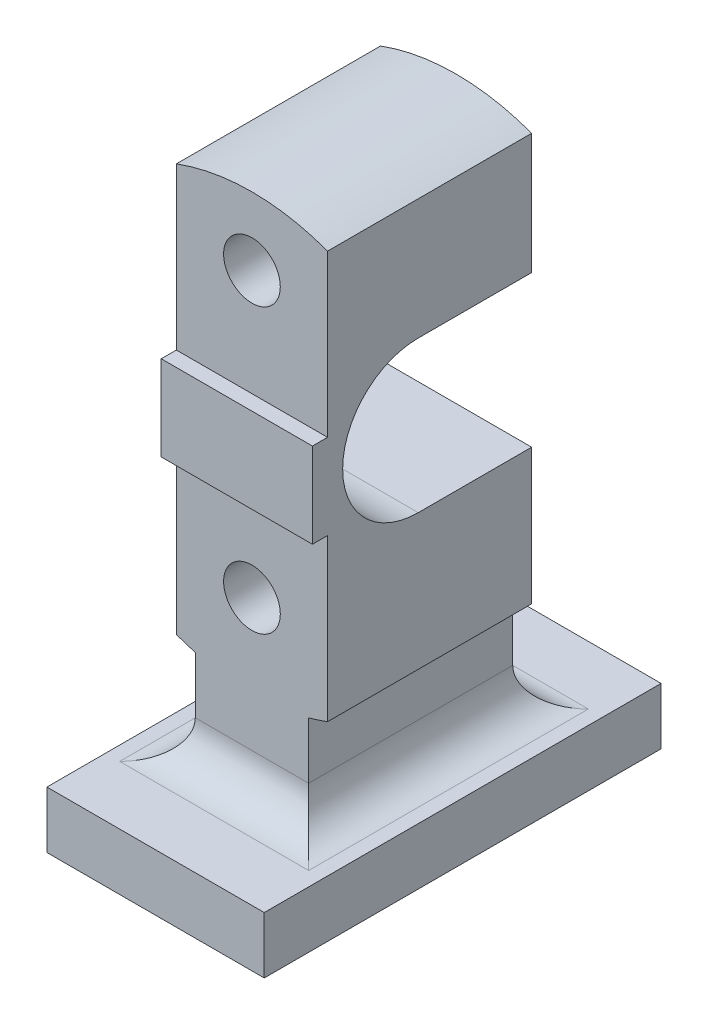
ISO-10303-21;
HEADER;
FILE_DESCRIPTION(('STEP AP214'),'2;1');
FILE_NAME('part.step','',(''),(''),'','','');
FILE_SCHEMA(('AUTOMOTIVE_DESIGN { 1 0 10303 214 1 1 1 1 }'));
ENDSEC;
DATA;
#1=APPLICATION_CONTEXT('core data for automotive mechanical design processes');
#2=APPLICATION_PROTOCOL_DEFINITION('international standard','automotive_design',2000,#1);
#3=PRODUCT_CONTEXT('',#1,'mechanical');
#4=PRODUCT('Part','Part','',(#3));
#5=PRODUCT_RELATED_PRODUCT_CATEGORY('part','',(#4));
#6=PRODUCT_DEFINITION_FORMATION('','',#4);
#7=PRODUCT_DEFINITION_CONTEXT('part definition',#1,'design');
#8=PRODUCT_DEFINITION('design','',#6,#7);
#9=PRODUCT_DEFINITION_SHAPE('','',#8);
#10=(LENGTH_UNIT() NAMED_UNIT(*) SI_UNIT(.MILLI.,.METRE.));
#11=(NAMED_UNIT(*) PLANE_ANGLE_UNIT() SI_UNIT($,.RADIAN.));
#12=(NAMED_UNIT(*) SI_UNIT($,.STERADIAN.) SOLID_ANGLE_UNIT());
#13=UNCERTAINTY_MEASURE_WITH_UNIT(LENGTH_MEASURE(1.E-05),#10,'distance_accuracy_value','');
#14=(GEOMETRIC_REPRESENTATION_CONTEXT(3) GLOBAL_UNCERTAINTY_ASSIGNED_CONTEXT((#13)) GLOBAL_UNIT_ASSIGNED_CONTEXT((#10,
#11,#12)) REPRESENTATION_CONTEXT('',''));
#15=CARTESIAN_POINT('',(0.,0.,0.));
#16=DIRECTION('',(0.,0.,1.));
#17=DIRECTION('',(1.,0.,0.));
#18=AXIS2_PLACEMENT_3D('',#15,#16,#17);
#19=CARTESIAN_POINT('',(40.,0.,54.));
#20=DIRECTION('',(1.,0.,0.));
#21=DIRECTION('',(0.,1.,0.));
#22=AXIS2_PLACEMENT_3D('',#19,#20,#21);
#23=PLANE('',#22);
#24=CARTESIAN_POINT('',(40.,3.98198344412737,5.99999999999998));
#25=DIRECTION('',(1.,0.,0.));
#26=DIRECTION('',(0.,1.,0.));
#27=AXIS2_PLACEMENT_3D('',#24,#25,#26);
#28=CIRCLE('',#27,40.);
#29=CARTESIAN_POINT('',(40.,-36.0180165558726,5.99999999999998));
#30=VERTEX_POINT('',#29);
#31=CARTESIAN_POINT('',(40.,43.9819834441274,5.99999999999998));
#32=VERTEX_POINT('',#31);
#33=EDGE_CURVE('E292',#30,#32,#28,.F.);
#34=ORIENTED_EDGE('',*,*,#33,.T.);
#35=DIRECTION('',(0.,0.,-1.));
#36=VECTOR('',#35,1.);
#37=CARTESIAN_POINT('',(40.,43.9819834441274,54.));
#38=LINE('',#37,#36);
#39=CARTESIAN_POINT('',(40.,43.9819834441274,-54.));
#40=VERTEX_POINT('',#39);
#41=EDGE_CURVE('E289',#32,#40,#38,.T.);
#42=ORIENTED_EDGE('',*,*,#41,.T.);
#43=DIRECTION('',(0.,-1.,0.));
#44=VECTOR('',#43,1.);
#45=CARTESIAN_POINT('',(40.,0.,-54.));
#46=LINE('',#45,#44);
#47=CARTESIAN_POINT('',(40.,107.819293264239,-54.));
#48=VERTEX_POINT('',#47);
#49=EDGE_CURVE('E358',#48,#40,#46,.T.);
#50=ORIENTED_EDGE('',*,*,#49,.F.);
#51=DIRECTION('',(0.,0.,-1.));
#52=VECTOR('',#51,1.);
#53=CARTESIAN_POINT('',(40.,107.819293264239,54.));
#54=LINE('',#53,#52);
#55=CARTESIAN_POINT('',(40.,107.819293264239,54.));
#56=VERTEX_POINT('',#55);
#57=EDGE_CURVE('E386',#56,#48,#54,.T.);
#58=ORIENTED_EDGE('',*,*,#57,.F.);
#59=DIRECTION('',(0.,-1.,0.));
#60=VECTOR('',#59,1.);
#61=CARTESIAN_POINT('',(40.,0.,54.));
#62=LINE('',#61,#60);
#63=CARTESIAN_POINT('',(40.,22.5,54.));
#64=VERTEX_POINT('',#63);
#65=EDGE_CURVE('E332',#56,#64,#62,.T.);
#66=ORIENTED_EDGE('',*,*,#65,.T.);
#67=DIRECTION('',(0.,0.,-1.));
#68=VECTOR('',#67,1.);
#69=CARTESIAN_POINT('',(40.,22.5,62.));
#70=LINE('',#69,#68);
#71=CARTESIAN_POINT('',(40.,22.5,62.));
#72=VERTEX_POINT('',#71);
#73=EDGE_CURVE('E317',#72,#64,#70,.T.);
#74=ORIENTED_EDGE('',*,*,#73,.F.);
#75=DIRECTION('',(0.,-1.,0.));
#76=VECTOR('',#75,1.);
#77=CARTESIAN_POINT('',(40.,0.,62.));
#78=LINE('',#77,#76);
#79=CARTESIAN_POINT('',(40.,-22.5,62.));
#80=VERTEX_POINT('',#79);
#81=EDGE_CURVE('E298',#72,#80,#78,.T.);
#82=ORIENTED_EDGE('',*,*,#81,.T.);
#83=DIRECTION('',(0.,0.,-1.));
#84=VECTOR('',#83,1.);
#85=CARTESIAN_POINT('',(40.,-22.5,62.));
#86=LINE('',#85,#84);
#87=CARTESIAN_POINT('',(40.,-22.5,54.));
#88=VERTEX_POINT('',#87);
#89=EDGE_CURVE('E321',#80,#88,#86,.T.);
#90=ORIENTED_EDGE('',*,*,#89,.T.);
#91=CARTESIAN_POINT('',(40.,-107.819293264239,54.));
#92=VERTEX_POINT('',#91);
#93=EDGE_CURVE('E330',#88,#92,#62,.T.);
#94=ORIENTED_EDGE('',*,*,#93,.T.);
#95=DIRECTION('',(0.,0.,-1.));
#96=VECTOR('',#95,1.);
#97=CARTESIAN_POINT('',(40.,-107.819293264239,54.));
#98=LINE('',#97,#96);
#99=CARTESIAN_POINT('',(40.,-107.819293264239,-54.));
#100=VERTEX_POINT('',#99);
#101=EDGE_CURVE('E389',#92,#100,#98,.T.);
#102=ORIENTED_EDGE('',*,*,#101,.T.);
#103=CARTESIAN_POINT('',(40.,-36.0180165558726,-54.));
#104=VERTEX_POINT('',#103);
#105=EDGE_CURVE('E357',#104,#100,#46,.T.);
#106=ORIENTED_EDGE('',*,*,#105,.F.);
#107=DIRECTION('',(0.,0.,1.));
#108=VECTOR('',#107,1.);
#109=CARTESIAN_POINT('',(40.,-36.0180165558726,54.));
#110=LINE('',#109,#108);
#111=EDGE_CURVE('E213',#104,#30,#110,.T.);
#112=ORIENTED_EDGE('',*,*,#111,.T.);
#113=EDGE_LOOP('',(#34,#42,#50,#58,#66,#74,#82,#90,#94,#102,#106,#112));
#114=FACE_BOUND('',#113,.T.);
#115=ADVANCED_FACE('F39',(#114),#23,.T.);
#116=CARTESIAN_POINT('',(-40.,0.,54.));
#117=DIRECTION('',(1.,0.,0.));
#118=DIRECTION('',(0.,0.,-1.));
#119=AXIS2_PLACEMENT_3D('',#116,#117,#118);
#120=PLANE('',#119);
#121=DIRECTION('',(0.,0.,-1.));
#122=VECTOR('',#121,1.);
#123=CARTESIAN_POINT('',(-40.,43.9819834441274,54.));
#124=LINE('',#123,#122);
#125=CARTESIAN_POINT('',(-40.,43.9819834441274,5.99999999999998));
#126=VERTEX_POINT('',#125);
#127=CARTESIAN_POINT('',(-40.,43.9819834441274,-54.));
#128=VERTEX_POINT('',#127);
#129=EDGE_CURVE('E285',#126,#128,#124,.T.);
#130=ORIENTED_EDGE('',*,*,#129,.F.);
#131=CARTESIAN_POINT('',(-40.,3.98198344412736,5.99999999999998));
#132=DIRECTION('',(1.,0.,0.));
#133=DIRECTION('',(0.,0.,-1.));
#134=AXIS2_PLACEMENT_3D('',#131,#132,#133);
#135=CIRCLE('',#134,40.);
#136=CARTESIAN_POINT('',(-40.,-36.0180165558726,5.99999999999998));
#137=VERTEX_POINT('',#136);
#138=EDGE_CURVE('E208',#137,#126,#135,.F.);
#139=ORIENTED_EDGE('',*,*,#138,.F.);
#140=DIRECTION('',(0.,0.,1.));
#141=VECTOR('',#140,1.);
#142=CARTESIAN_POINT('',(-40.,-36.0180165558726,54.));
#143=LINE('',#142,#141);
#144=CARTESIAN_POINT('',(-40.,-36.0180165558726,-54.));
#145=VERTEX_POINT('',#144);
#146=EDGE_CURVE('E205',#145,#137,#143,.T.);
#147=ORIENTED_EDGE('',*,*,#146,.F.);
#148=DIRECTION('',(0.,-1.,0.));
#149=VECTOR('',#148,1.);
#150=CARTESIAN_POINT('',(-40.,0.,-54.));
#151=LINE('',#150,#149);
#152=CARTESIAN_POINT('',(-40.,-107.819293264239,-54.));
#153=VERTEX_POINT('',#152);
#154=EDGE_CURVE('E190',#145,#153,#151,.T.);
#155=ORIENTED_EDGE('',*,*,#154,.T.);
#156=DIRECTION('',(0.,0.,-1.));
#157=VECTOR('',#156,1.);
#158=CARTESIAN_POINT('',(-40.,-107.819293264239,54.));
#159=LINE('',#158,#157);
#160=CARTESIAN_POINT('',(-40.,-107.819293264239,54.));
#161=VERTEX_POINT('',#160);
#162=EDGE_CURVE('E379',#161,#153,#159,.T.);
#163=ORIENTED_EDGE('',*,*,#162,.F.);
#164=DIRECTION('',(0.,-1.,0.));
#165=VECTOR('',#164,1.);
#166=CARTESIAN_POINT('',(-40.,0.,54.));
#167=LINE('',#166,#165);
#168=CARTESIAN_POINT('',(-40.,-22.5,54.));
#169=VERTEX_POINT('',#168);
#170=EDGE_CURVE('E339',#169,#161,#167,.T.);
#171=ORIENTED_EDGE('',*,*,#170,.F.);
#172=DIRECTION('',(0.,0.,-1.));
#173=VECTOR('',#172,1.);
#174=CARTESIAN_POINT('',(-40.,-22.5,62.));
#175=LINE('',#174,#173);
#176=CARTESIAN_POINT('',(-40.,-22.5,62.));
#177=VERTEX_POINT('',#176);
#178=EDGE_CURVE('E309',#177,#169,#175,.T.);
#179=ORIENTED_EDGE('',*,*,#178,.F.);
#180=DIRECTION('',(0.,-1.,0.));
#181=VECTOR('',#180,1.);
#182=CARTESIAN_POINT('',(-40.,0.,62.));
#183=LINE('',#182,#181);
#184=CARTESIAN_POINT('',(-40.,22.5,62.));
#185=VERTEX_POINT('',#184);
#186=EDGE_CURVE('E306',#185,#177,#183,.T.);
#187=ORIENTED_EDGE('',*,*,#186,.F.);
#188=DIRECTION('',(0.,0.,-1.));
#189=VECTOR('',#188,1.);
#190=CARTESIAN_POINT('',(-40.,22.5,62.));
#191=LINE('',#190,#189);
#192=CARTESIAN_POINT('',(-40.,22.5,54.));
#193=VERTEX_POINT('',#192);
#194=EDGE_CURVE('E313',#185,#193,#191,.T.);
#195=ORIENTED_EDGE('',*,*,#194,.T.);
#196=CARTESIAN_POINT('',(-40.,107.819293264239,54.));
#197=VERTEX_POINT('',#196);
#198=EDGE_CURVE('E340',#197,#193,#167,.T.);
#199=ORIENTED_EDGE('',*,*,#198,.F.);
#200=DIRECTION('',(0.,0.,-1.));
#201=VECTOR('',#200,1.);
#202=CARTESIAN_POINT('',(-40.,107.819293264239,54.));
#203=LINE('',#202,#201);
#204=CARTESIAN_POINT('',(-40.,107.819293264239,-54.));
#205=VERTEX_POINT('',#204);
#206=EDGE_CURVE('E382',#197,#205,#203,.T.);
#207=ORIENTED_EDGE('',*,*,#206,.T.);
#208=EDGE_CURVE('E201',#205,#128,#151,.T.);
#209=ORIENTED_EDGE('',*,*,#208,.T.);
#210=EDGE_LOOP('',(#130,#139,#147,#155,#163,#171,#179,#187,#195,#199,#207,#209));
#211=FACE_BOUND('',#210,.T.);
#212=ADVANCED_FACE('F206',(#211),#120,.F.);
#213=CARTESIAN_POINT('',(0.,0.,-54.));
#214=DIRECTION('',(0.,0.,1.));
#215=DIRECTION('',(1.,0.,0.));
#216=AXIS2_PLACEMENT_3D('',#213,#214,#215);
#217=PLANE('',#216);
#218=CARTESIAN_POINT('',(0.,78.9819834441274,-54.));
#219=DIRECTION('',(0.,0.,1.));
#220=DIRECTION('',(1.,0.,0.));
#221=AXIS2_PLACEMENT_3D('',#218,#219,#220);
#222=CIRCLE('',#221,15.);
#223=CARTESIAN_POINT('',(15.,78.9819834441274,-54.));
#224=VERTEX_POINT('',#223);
#225=EDGE_CURVE('E815',#224,#224,#222,.T.);
#226=ORIENTED_EDGE('',*,*,#225,.T.);
#227=EDGE_LOOP('',(#226));
#228=FACE_BOUND('',#227,.T.);
#229=DIRECTION('',(1.,0.,0.));
#230=VECTOR('',#229,1.);
#231=CARTESIAN_POINT('',(0.,43.9819834441274,-54.));
#232=LINE('',#231,#230);
#233=EDGE_CURVE('E219',#128,#40,#232,.T.);
#234=ORIENTED_EDGE('',*,*,#233,.F.);
#235=ORIENTED_EDGE('',*,*,#208,.F.);
#236=CARTESIAN_POINT('',(0.,0.,-54.));
#237=DIRECTION('',(0.,0.,1.));
#238=DIRECTION('',(1.,0.,0.));
#239=AXIS2_PLACEMENT_3D('',#236,#237,#238);
#240=CIRCLE('',#239,115.);
#241=EDGE_CURVE('E202',#48,#205,#240,.T.);
#242=ORIENTED_EDGE('',*,*,#241,.F.);
#243=ORIENTED_EDGE('',*,*,#49,.T.);
#244=EDGE_LOOP('',(#234,#235,#242,#243));
#245=FACE_BOUND('',#244,.T.);
#246=ADVANCED_FACE('F461',(#228,#245),#217,.F.);
#247=CARTESIAN_POINT('',(0.,-71.0180165558726,-54.));
#248=DIRECTION('',(0.,0.,1.));
#249=DIRECTION('',(1.,0.,0.));
#250=AXIS2_PLACEMENT_3D('',#247,#248,#249);
#251=CIRCLE('',#250,15.);
#252=CARTESIAN_POINT('',(15.,-71.0180165558726,-54.));
#253=VERTEX_POINT('',#252);
#254=EDGE_CURVE('E258',#253,#253,#251,.T.);
#255=ORIENTED_EDGE('',*,*,#254,.T.);
#256=EDGE_LOOP('',(#255));
#257=FACE_BOUND('',#256,.T.);
#258=DIRECTION('',(0.,-1.,0.));
#259=VECTOR('',#258,1.);
#260=CARTESIAN_POINT('',(30.,0.,-54.));
#261=LINE('',#260,#259);
#262=CARTESIAN_POINT('',(30.,-111.018016555873,-54.));
#263=VERTEX_POINT('',#262);
#264=CARTESIAN_POINT('',(30.,-141.018016555873,-54.));
#265=VERTEX_POINT('',#264);
#266=EDGE_CURVE('E331',#263,#265,#261,.T.);
#267=ORIENTED_EDGE('',*,*,#266,.T.);
#268=DIRECTION('',(1.,0.,0.));
#269=VECTOR('',#268,1.);
#270=CARTESIAN_POINT('',(0.,-141.018016555873,-54.));
#271=LINE('',#270,#269);
#272=CARTESIAN_POINT('',(-30.,-141.018016555873,-54.));
#273=VERTEX_POINT('',#272);
#274=EDGE_CURVE('E49',#265,#273,#271,.F.);
#275=ORIENTED_EDGE('',*,*,#274,.T.);
#276=DIRECTION('',(0.,-1.,0.));
#277=VECTOR('',#276,1.);
#278=CARTESIAN_POINT('',(-30.,0.,-54.));
#279=LINE('',#278,#277);
#280=CARTESIAN_POINT('',(-30.,-111.018016555873,-54.));
#281=VERTEX_POINT('',#280);
#282=EDGE_CURVE('E368',#281,#273,#279,.T.);
#283=ORIENTED_EDGE('',*,*,#282,.F.);
#284=CARTESIAN_POINT('',(0.,0.,-54.));
#285=DIRECTION('',(0.,0.,1.));
#286=DIRECTION('',(1.,0.,0.));
#287=AXIS2_PLACEMENT_3D('',#284,#285,#286);
#288=CIRCLE('',#287,115.);
#289=EDGE_CURVE('E196',#153,#281,#288,.T.);
#290=ORIENTED_EDGE('',*,*,#289,.F.);
#291=ORIENTED_EDGE('',*,*,#154,.F.);
#292=DIRECTION('',(-1.,0.,0.));
#293=VECTOR('',#292,1.);
#294=CARTESIAN_POINT('',(0.,-36.0180165558726,-54.));
#295=LINE('',#294,#293);
#296=EDGE_CURVE('E194',#104,#145,#295,.T.);
#297=ORIENTED_EDGE('',*,*,#296,.F.);
#298=ORIENTED_EDGE('',*,*,#105,.T.);
#299=CARTESIAN_POINT('',(0.,0.,-54.));
#300=DIRECTION('',(0.,0.,1.));
#301=DIRECTION('',(1.,0.,0.));
#302=AXIS2_PLACEMENT_3D('',#299,#300,#301);
#303=CIRCLE('',#302,115.);
#304=EDGE_CURVE('E325',#263,#100,#303,.T.);
#305=ORIENTED_EDGE('',*,*,#304,.F.);
#306=EDGE_LOOP('',(#267,#275,#283,#290,#291,#297,#298,#305));
#307=FACE_BOUND('',#306,.T.);
#308=ADVANCED_FACE('F192',(#257,#307),#217,.F.);
#309=CARTESIAN_POINT('',(0.,0.,54.));
#310=DIRECTION('',(0.,0.,1.));
#311=DIRECTION('',(1.,0.,0.));
#312=AXIS2_PLACEMENT_3D('',#309,#310,#311);
#313=PLANE('',#312);
#314=CARTESIAN_POINT('',(0.,-71.0180165558726,54.));
#315=DIRECTION('',(0.,0.,1.));
#316=DIRECTION('',(1.,0.,0.));
#317=AXIS2_PLACEMENT_3D('',#314,#315,#316);
#318=CIRCLE('',#317,15.);
#319=CARTESIAN_POINT('',(15.,-71.0180165558726,54.));
#320=VERTEX_POINT('',#319);
#321=EDGE_CURVE('E811',#320,#320,#318,.T.);
#322=ORIENTED_EDGE('',*,*,#321,.F.);
#323=EDGE_LOOP('',(#322));
#324=FACE_BOUND('',#323,.T.);
#325=DIRECTION('',(0.,-1.,0.));
#326=VECTOR('',#325,1.);
#327=CARTESIAN_POINT('',(-30.,0.,54.));
#328=LINE('',#327,#326);
#329=CARTESIAN_POINT('',(-30.,-111.018016555873,54.));
#330=VERTEX_POINT('',#329);
#331=CARTESIAN_POINT('',(-30.,-141.018016555873,54.));
#332=VERTEX_POINT('',#331);
#333=EDGE_CURVE('E346',#330,#332,#328,.T.);
#334=ORIENTED_EDGE('',*,*,#333,.T.);
#335=DIRECTION('',(1.,0.,0.));
#336=VECTOR('',#335,1.);
#337=CARTESIAN_POINT('',(30.,-141.018016555873,54.));
#338=LINE('',#337,#336);
#339=CARTESIAN_POINT('',(30.,-141.018016555873,54.));
#340=VERTEX_POINT('',#339);
#341=EDGE_CURVE('E233',#332,#340,#338,.T.);
#342=ORIENTED_EDGE('',*,*,#341,.T.);
#343=DIRECTION('',(0.,-1.,0.));
#344=VECTOR('',#343,1.);
#345=CARTESIAN_POINT('',(30.,0.,54.));
#346=LINE('',#345,#344);
#347=CARTESIAN_POINT('',(30.,-111.018016555873,54.));
#348=VERTEX_POINT('',#347);
#349=EDGE_CURVE('E350',#348,#340,#346,.T.);
#350=ORIENTED_EDGE('',*,*,#349,.F.);
#351=CARTESIAN_POINT('',(0.,0.,54.));
#352=DIRECTION('',(0.,0.,1.));
#353=DIRECTION('',(1.,0.,0.));
#354=AXIS2_PLACEMENT_3D('',#351,#352,#353);
#355=CIRCLE('',#354,115.);
#356=EDGE_CURVE('E326',#348,#92,#355,.T.);
#357=ORIENTED_EDGE('',*,*,#356,.T.);
#358=ORIENTED_EDGE('',*,*,#93,.F.);
#359=DIRECTION('',(-1.,0.,0.));
#360=VECTOR('',#359,1.);
#361=CARTESIAN_POINT('',(0.,-22.5,54.));
#362=LINE('',#361,#360);
#363=EDGE_CURVE('E220',#88,#169,#362,.T.);
#364=ORIENTED_EDGE('',*,*,#363,.T.);
#365=ORIENTED_EDGE('',*,*,#170,.T.);
#366=CARTESIAN_POINT('',(0.,0.,54.));
#367=DIRECTION('',(0.,0.,1.));
#368=DIRECTION('',(1.,0.,0.));
#369=AXIS2_PLACEMENT_3D('',#366,#367,#368);
#370=CIRCLE('',#369,115.);
#371=EDGE_CURVE('E343',#161,#330,#370,.T.);
#372=ORIENTED_EDGE('',*,*,#371,.T.);
#373=EDGE_LOOP('',(#334,#342,#350,#357,#358,#364,#365,#372));
#374=FACE_BOUND('',#373,.T.);
#375=ADVANCED_FACE('F473',(#324,#374),#313,.T.);
#376=CARTESIAN_POINT('',(0.,-161.018016555873,105.));
#377=DIRECTION('',(0.,1.,0.));
#378=DIRECTION('',(0.,0.,1.));
#379=AXIS2_PLACEMENT_3D('',#376,#377,#378);
#380=PLANE('',#379);
#381=DIRECTION('',(0.,0.,-1.));
#382=VECTOR('',#381,1.);
#383=CARTESIAN_POINT('',(50.,-161.018016555873,54.));
#384=LINE('',#383,#382);
#385=CARTESIAN_POINT('',(50.,-161.018016555873,-74.));
#386=VERTEX_POINT('',#385);
#387=CARTESIAN_POINT('',(50.,-161.018016555873,74.));
#388=VERTEX_POINT('',#387);
#389=EDGE_CURVE('E243',#386,#388,#384,.F.);
#390=ORIENTED_EDGE('',*,*,#389,.T.);
#391=DIRECTION('',(1.,0.,0.));
#392=VECTOR('',#391,1.);
#393=CARTESIAN_POINT('',(-30.,-161.018016555873,74.));
#394=LINE('',#393,#392);
#395=CARTESIAN_POINT('',(-50.,-161.018016555873,74.));
#396=VERTEX_POINT('',#395);
#397=EDGE_CURVE('E246',#388,#396,#394,.F.);
#398=ORIENTED_EDGE('',*,*,#397,.T.);
#399=DIRECTION('',(0.,0.,-1.));
#400=VECTOR('',#399,1.);
#401=CARTESIAN_POINT('',(-50.,-161.018016555873,105.));
#402=LINE('',#401,#400);
#403=CARTESIAN_POINT('',(-50.,-161.018016555873,-74.));
#404=VERTEX_POINT('',#403);
#405=EDGE_CURVE('E237',#396,#404,#402,.T.);
#406=ORIENTED_EDGE('',*,*,#405,.T.);
#407=DIRECTION('',(1.,0.,0.));
#408=VECTOR('',#407,1.);
#409=CARTESIAN_POINT('',(0.,-161.018016555873,-74.));
#410=LINE('',#409,#408);
#411=EDGE_CURVE('E240',#404,#386,#410,.T.);
#412=ORIENTED_EDGE('',*,*,#411,.T.);
#413=EDGE_LOOP('',(#390,#398,#406,#412));
#414=FACE_BOUND('',#413,.T.);
#415=DIRECTION('',(1.,0.,0.));
#416=VECTOR('',#415,1.);
#417=CARTESIAN_POINT('',(0.,-161.018016555873,-105.));
#418=LINE('',#417,#416);
#419=CARTESIAN_POINT('',(-57.5,-161.018016555873,-105.));
#420=VERTEX_POINT('',#419);
#421=CARTESIAN_POINT('',(57.5,-161.018016555873,-105.));
#422=VERTEX_POINT('',#421);
#423=EDGE_CURVE('E393',#420,#422,#418,.T.);
#424=ORIENTED_EDGE('',*,*,#423,.F.);
#425=DIRECTION('',(0.,0.,-1.));
#426=VECTOR('',#425,1.);
#427=CARTESIAN_POINT('',(-57.5,-161.018016555873,105.));
#428=LINE('',#427,#426);
#429=CARTESIAN_POINT('',(-57.5,-161.018016555873,105.));
#430=VERTEX_POINT('',#429);
#431=EDGE_CURVE('E434',#430,#420,#428,.T.);
#432=ORIENTED_EDGE('',*,*,#431,.F.);
#433=DIRECTION('',(1.,0.,0.));
#434=VECTOR('',#433,1.);
#435=CARTESIAN_POINT('',(0.,-161.018016555873,105.));
#436=LINE('',#435,#434);
#437=CARTESIAN_POINT('',(57.5,-161.018016555873,105.));
#438=VERTEX_POINT('',#437);
#439=EDGE_CURVE('E394',#430,#438,#436,.T.);
#440=ORIENTED_EDGE('',*,*,#439,.T.);
#441=DIRECTION('',(0.,0.,-1.));
#442=VECTOR('',#441,1.);
#443=CARTESIAN_POINT('',(57.5,-161.018016555873,105.));
#444=LINE('',#443,#442);
#445=EDGE_CURVE('E411',#438,#422,#444,.T.);
#446=ORIENTED_EDGE('',*,*,#445,.T.);
#447=EDGE_LOOP('',(#424,#432,#440,#446));
#448=FACE_BOUND('',#447,.T.);
#449=ADVANCED_FACE('F530',(#414,#448),#380,.T.);
#450=CARTESIAN_POINT('',(-57.5,0.,105.));
#451=DIRECTION('',(-1.,0.,0.));
#452=DIRECTION('',(0.,0.,1.));
#453=AXIS2_PLACEMENT_3D('',#450,#451,#452);
#454=PLANE('',#453);
#455=DIRECTION('',(0.,1.,0.));
#456=VECTOR('',#455,1.);
#457=CARTESIAN_POINT('',(-57.5,0.,-105.));
#458=LINE('',#457,#456);
#459=CARTESIAN_POINT('',(-57.5,-191.018016555873,-105.));
#460=VERTEX_POINT('',#459);
#461=EDGE_CURVE('E415',#460,#420,#458,.T.);
#462=ORIENTED_EDGE('',*,*,#461,.F.);
#463=DIRECTION('',(0.,0.,-1.));
#464=VECTOR('',#463,1.);
#465=CARTESIAN_POINT('',(-57.5,-191.018016555873,105.));
#466=LINE('',#465,#464);
#467=CARTESIAN_POINT('',(-57.5,-191.018016555873,105.));
#468=VERTEX_POINT('',#467);
#469=EDGE_CURVE('E431',#468,#460,#466,.T.);
#470=ORIENTED_EDGE('',*,*,#469,.F.);
#471=DIRECTION('',(0.,1.,0.));
#472=VECTOR('',#471,1.);
#473=CARTESIAN_POINT('',(-57.5,0.,105.));
#474=LINE('',#473,#472);
#475=EDGE_CURVE('E398',#468,#430,#474,.T.);
#476=ORIENTED_EDGE('',*,*,#475,.T.);
#477=ORIENTED_EDGE('',*,*,#431,.T.);
#478=EDGE_LOOP('',(#462,#470,#476,#477));
#479=FACE_BOUND('',#478,.T.);
#480=ADVANCED_FACE('F526',(#479),#454,.T.);
#481=CARTESIAN_POINT('',(0.,-191.018016555873,105.));
#482=DIRECTION('',(0.,-1.,0.));
#483=DIRECTION('',(0.,0.,-1.));
#484=AXIS2_PLACEMENT_3D('',#481,#482,#483);
#485=PLANE('',#484);
#486=DIRECTION('',(-1.,0.,0.));
#487=VECTOR('',#486,1.);
#488=CARTESIAN_POINT('',(0.,-191.018016555873,-105.));
#489=LINE('',#488,#487);
#490=CARTESIAN_POINT('',(57.5,-191.018016555873,-105.));
#491=VERTEX_POINT('',#490);
#492=EDGE_CURVE('E419',#491,#460,#489,.T.);
#493=ORIENTED_EDGE('',*,*,#492,.F.);
#494=DIRECTION('',(0.,0.,-1.));
#495=VECTOR('',#494,1.);
#496=CARTESIAN_POINT('',(57.5,-191.018016555873,105.));
#497=LINE('',#496,#495);
#498=CARTESIAN_POINT('',(57.5,-191.018016555873,105.));
#499=VERTEX_POINT('',#498);
#500=EDGE_CURVE('E428',#499,#491,#497,.T.);
#501=ORIENTED_EDGE('',*,*,#500,.F.);
#502=DIRECTION('',(-1.,0.,0.));
#503=VECTOR('',#502,1.);
#504=CARTESIAN_POINT('',(0.,-191.018016555873,105.));
#505=LINE('',#504,#503);
#506=EDGE_CURVE('E403',#499,#468,#505,.T.);
#507=ORIENTED_EDGE('',*,*,#506,.T.);
#508=ORIENTED_EDGE('',*,*,#469,.T.);
#509=EDGE_LOOP('',(#493,#501,#507,#508));
#510=FACE_BOUND('',#509,.T.);
#511=ADVANCED_FACE('F522',(#510),#485,.T.);
#512=CARTESIAN_POINT('',(57.5,0.,105.));
#513=DIRECTION('',(1.,0.,0.));
#514=DIRECTION('',(0.,0.,-1.));
#515=AXIS2_PLACEMENT_3D('',#512,#513,#514);
#516=PLANE('',#515);
#517=DIRECTION('',(0.,-1.,0.));
#518=VECTOR('',#517,1.);
#519=CARTESIAN_POINT('',(57.5,0.,-105.));
#520=LINE('',#519,#518);
#521=EDGE_CURVE('E399',#422,#491,#520,.T.);
#522=ORIENTED_EDGE('',*,*,#521,.F.);
#523=ORIENTED_EDGE('',*,*,#445,.F.);
#524=DIRECTION('',(0.,-1.,0.));
#525=VECTOR('',#524,1.);
#526=CARTESIAN_POINT('',(57.5,0.,105.));
#527=LINE('',#526,#525);
#528=EDGE_CURVE('E407',#438,#499,#527,.T.);
#529=ORIENTED_EDGE('',*,*,#528,.T.);
#530=ORIENTED_EDGE('',*,*,#500,.T.);
#531=EDGE_LOOP('',(#522,#523,#529,#530));
#532=FACE_BOUND('',#531,.T.);
#533=ADVANCED_FACE('F515',(#532),#516,.T.);
#534=CARTESIAN_POINT('',(0.,0.,105.));
#535=DIRECTION('',(0.,0.,1.));
#536=DIRECTION('',(1.,0.,0.));
#537=AXIS2_PLACEMENT_3D('',#534,#535,#536);
#538=PLANE('',#537);
#539=ORIENTED_EDGE('',*,*,#439,.F.);
#540=ORIENTED_EDGE('',*,*,#475,.F.);
#541=ORIENTED_EDGE('',*,*,#506,.F.);
#542=ORIENTED_EDGE('',*,*,#528,.F.);
#543=EDGE_LOOP('',(#539,#540,#541,#542));
#544=FACE_BOUND('',#543,.T.);
#545=ADVANCED_FACE('F512',(#544),#538,.T.);
#546=CARTESIAN_POINT('',(0.,0.,-105.));
#547=DIRECTION('',(0.,0.,1.));
#548=DIRECTION('',(1.,0.,0.));
#549=AXIS2_PLACEMENT_3D('',#546,#547,#548);
#550=PLANE('',#549);
#551=ORIENTED_EDGE('',*,*,#423,.T.);
#552=ORIENTED_EDGE('',*,*,#521,.T.);
#553=ORIENTED_EDGE('',*,*,#492,.T.);
#554=ORIENTED_EDGE('',*,*,#461,.T.);
#555=EDGE_LOOP('',(#551,#552,#553,#554));
#556=FACE_BOUND('',#555,.T.);
#557=ADVANCED_FACE('F510',(#556),#550,.F.);
#558=CARTESIAN_POINT('',(0.,0.,54.));
#559=DIRECTION('',(0.,0.,-1.));
#560=DIRECTION('',(-1.,0.,0.));
#561=AXIS2_PLACEMENT_3D('',#558,#559,#560);
#562=CYLINDRICAL_SURFACE('',#561,115.);
#563=ORIENTED_EDGE('',*,*,#304,.T.);
#564=ORIENTED_EDGE('',*,*,#101,.F.);
#565=ORIENTED_EDGE('',*,*,#356,.F.);
#566=DIRECTION('',(0.,0.,-1.));
#567=VECTOR('',#566,1.);
#568=CARTESIAN_POINT('',(30.,-111.018016555873,54.));
#569=LINE('',#568,#567);
#570=EDGE_CURVE('E353',#348,#263,#569,.T.);
#571=ORIENTED_EDGE('',*,*,#570,.T.);
#572=EDGE_LOOP('',(#563,#564,#565,#571));
#573=FACE_BOUND('',#572,.T.);
#574=ADVANCED_FACE('F507',(#573),#562,.T.);
#575=CARTESIAN_POINT('',(0.,0.,54.));
#576=DIRECTION('',(0.,0.,-1.));
#577=DIRECTION('',(-1.,0.,0.));
#578=AXIS2_PLACEMENT_3D('',#575,#576,#577);
#579=CYLINDRICAL_SURFACE('',#578,115.);
#580=ORIENTED_EDGE('',*,*,#241,.T.);
#581=ORIENTED_EDGE('',*,*,#206,.F.);
#582=CARTESIAN_POINT('',(0.,0.,54.));
#583=DIRECTION('',(0.,0.,1.));
#584=DIRECTION('',(1.,0.,0.));
#585=AXIS2_PLACEMENT_3D('',#582,#583,#584);
#586=CIRCLE('',#585,115.);
#587=EDGE_CURVE('E336',#56,#197,#586,.T.);
#588=ORIENTED_EDGE('',*,*,#587,.F.);
#589=ORIENTED_EDGE('',*,*,#57,.T.);
#590=EDGE_LOOP('',(#580,#581,#588,#589));
#591=FACE_BOUND('',#590,.T.);
#592=ADVANCED_FACE('F457',(#591),#579,.T.);
#593=CARTESIAN_POINT('',(0.,0.,54.));
#594=DIRECTION('',(0.,0.,-1.));
#595=DIRECTION('',(-1.,0.,0.));
#596=AXIS2_PLACEMENT_3D('',#593,#594,#595);
#597=CYLINDRICAL_SURFACE('',#596,115.);
#598=ORIENTED_EDGE('',*,*,#289,.T.);
#599=DIRECTION('',(0.,0.,-1.));
#600=VECTOR('',#599,1.);
#601=CARTESIAN_POINT('',(-30.,-111.018016555873,54.));
#602=LINE('',#601,#600);
#603=EDGE_CURVE('E375',#330,#281,#602,.T.);
#604=ORIENTED_EDGE('',*,*,#603,.F.);
#605=ORIENTED_EDGE('',*,*,#371,.F.);
#606=ORIENTED_EDGE('',*,*,#162,.T.);
#607=EDGE_LOOP('',(#598,#604,#605,#606));
#608=FACE_BOUND('',#607,.T.);
#609=ADVANCED_FACE('F478',(#608),#597,.T.);
#610=CARTESIAN_POINT('',(-30.,0.,54.));
#611=DIRECTION('',(1.,0.,0.));
#612=DIRECTION('',(0.,1.,0.));
#613=AXIS2_PLACEMENT_3D('',#610,#611,#612);
#614=PLANE('',#613);
#615=ORIENTED_EDGE('',*,*,#282,.T.);
#616=DIRECTION('',(0.,0.,-1.));
#617=VECTOR('',#616,1.);
#618=CARTESIAN_POINT('',(-30.,-141.018016555873,54.));
#619=LINE('',#618,#617);
#620=EDGE_CURVE('E11',#273,#332,#619,.F.);
#621=ORIENTED_EDGE('',*,*,#620,.T.);
#622=ORIENTED_EDGE('',*,*,#333,.F.);
#623=ORIENTED_EDGE('',*,*,#603,.T.);
#624=EDGE_LOOP('',(#615,#621,#622,#623));
#625=FACE_BOUND('',#624,.T.);
#626=ADVANCED_FACE('F481',(#625),#614,.F.);
#627=CARTESIAN_POINT('',(30.,0.,54.));
#628=DIRECTION('',(1.,0.,0.));
#629=DIRECTION('',(0.,1.,0.));
#630=AXIS2_PLACEMENT_3D('',#627,#628,#629);
#631=PLANE('',#630);
#632=ORIENTED_EDGE('',*,*,#349,.T.);
#633=DIRECTION('',(0.,0.,-1.));
#634=VECTOR('',#633,1.);
#635=CARTESIAN_POINT('',(30.,-141.018016555873,-54.));
#636=LINE('',#635,#634);
#637=EDGE_CURVE('E64',#340,#265,#636,.T.);
#638=ORIENTED_EDGE('',*,*,#637,.T.);
#639=ORIENTED_EDGE('',*,*,#266,.F.);
#640=ORIENTED_EDGE('',*,*,#570,.F.);
#641=EDGE_LOOP('',(#632,#638,#639,#640));
#642=FACE_BOUND('',#641,.T.);
#643=ADVANCED_FACE('F573',(#642),#631,.T.);
#644=CARTESIAN_POINT('',(0.,78.9819834441274,54.));
#645=DIRECTION('',(0.,0.,1.));
#646=DIRECTION('',(1.,0.,0.));
#647=AXIS2_PLACEMENT_3D('',#644,#645,#646);
#648=CIRCLE('',#647,15.);
#649=CARTESIAN_POINT('',(15.,78.9819834441274,54.));
#650=VERTEX_POINT('',#649);
#651=EDGE_CURVE('E820',#650,#650,#648,.T.);
#652=ORIENTED_EDGE('',*,*,#651,.F.);
#653=EDGE_LOOP('',(#652));
#654=FACE_BOUND('',#653,.T.);
#655=DIRECTION('',(-1.,0.,0.));
#656=VECTOR('',#655,1.);
#657=CARTESIAN_POINT('',(0.,22.5,54.));
#658=LINE('',#657,#656);
#659=EDGE_CURVE('E227',#64,#193,#658,.T.);
#660=ORIENTED_EDGE('',*,*,#659,.F.);
#661=ORIENTED_EDGE('',*,*,#65,.F.);
#662=ORIENTED_EDGE('',*,*,#587,.T.);
#663=ORIENTED_EDGE('',*,*,#198,.T.);
#664=EDGE_LOOP('',(#660,#661,#662,#663));
#665=FACE_BOUND('',#664,.T.);
#666=ADVANCED_FACE('F454',(#654,#665),#313,.T.);
#667=CARTESIAN_POINT('',(0.,-22.5,62.));
#668=DIRECTION('',(0.,1.,0.));
#669=DIRECTION('',(0.,0.,1.));
#670=AXIS2_PLACEMENT_3D('',#667,#668,#669);
#671=PLANE('',#670);
#672=ORIENTED_EDGE('',*,*,#363,.F.);
#673=ORIENTED_EDGE('',*,*,#89,.F.);
#674=DIRECTION('',(1.,0.,0.));
#675=VECTOR('',#674,1.);
#676=CARTESIAN_POINT('',(0.,-22.5,62.));
#677=LINE('',#676,#675);
#678=EDGE_CURVE('E295',#177,#80,#677,.T.);
#679=ORIENTED_EDGE('',*,*,#678,.F.);
#680=ORIENTED_EDGE('',*,*,#178,.T.);
#681=EDGE_LOOP('',(#672,#673,#679,#680));
#682=FACE_BOUND('',#681,.T.);
#683=ADVANCED_FACE('F568',(#682),#671,.F.);
#684=CARTESIAN_POINT('',(0.,22.5,62.));
#685=DIRECTION('',(0.,1.,0.));
#686=DIRECTION('',(0.,0.,1.));
#687=AXIS2_PLACEMENT_3D('',#684,#685,#686);
#688=PLANE('',#687);
#689=ORIENTED_EDGE('',*,*,#73,.T.);
#690=ORIENTED_EDGE('',*,*,#659,.T.);
#691=ORIENTED_EDGE('',*,*,#194,.F.);
#692=DIRECTION('',(1.,0.,0.));
#693=VECTOR('',#692,1.);
#694=CARTESIAN_POINT('',(0.,22.5,62.));
#695=LINE('',#694,#693);
#696=EDGE_CURVE('E302',#185,#72,#695,.T.);
#697=ORIENTED_EDGE('',*,*,#696,.T.);
#698=EDGE_LOOP('',(#689,#690,#691,#697));
#699=FACE_BOUND('',#698,.T.);
#700=ADVANCED_FACE('F439',(#699),#688,.T.);
#701=CARTESIAN_POINT('',(0.,0.,62.));
#702=DIRECTION('',(0.,0.,1.));
#703=DIRECTION('',(1.,0.,0.));
#704=AXIS2_PLACEMENT_3D('',#701,#702,#703);
#705=PLANE('',#704);
#706=ORIENTED_EDGE('',*,*,#678,.T.);
#707=ORIENTED_EDGE('',*,*,#81,.F.);
#708=ORIENTED_EDGE('',*,*,#696,.F.);
#709=ORIENTED_EDGE('',*,*,#186,.T.);
#710=EDGE_LOOP('',(#706,#707,#708,#709));
#711=FACE_BOUND('',#710,.T.);
#712=ADVANCED_FACE('F449',(#711),#705,.T.);
#713=CARTESIAN_POINT('',(525.688986223422,3.98198344412745,5.99999999999998));
#714=DIRECTION('',(-1.,0.,0.));
#715=DIRECTION('',(0.,-1.,0.));
#716=AXIS2_PLACEMENT_3D('',#713,#714,#715);
#717=CYLINDRICAL_SURFACE('',#716,40.);
#718=ORIENTED_EDGE('',*,*,#33,.F.);
#719=DIRECTION('',(-1.,0.,0.));
#720=VECTOR('',#719,1.);
#721=CARTESIAN_POINT('',(525.688986223422,-36.0180165558725,5.99999999999998));
#722=LINE('',#721,#720);
#723=EDGE_CURVE('E268',#30,#137,#722,.T.);
#724=ORIENTED_EDGE('',*,*,#723,.T.);
#725=ORIENTED_EDGE('',*,*,#138,.T.);
#726=DIRECTION('',(-1.,0.,0.));
#727=VECTOR('',#726,1.);
#728=CARTESIAN_POINT('',(525.688986223422,43.9819834441275,5.99999999999998));
#729=LINE('',#728,#727);
#730=EDGE_CURVE('E214',#32,#126,#729,.T.);
#731=ORIENTED_EDGE('',*,*,#730,.F.);
#732=EDGE_LOOP('',(#718,#724,#725,#731));
#733=FACE_BOUND('',#732,.T.);
#734=ADVANCED_FACE('F466',(#733),#717,.F.);
#735=CARTESIAN_POINT('',(525.688986223422,43.9819834441275,5.99999999999998));
#736=DIRECTION('',(0.,-1.,0.));
#737=DIRECTION('',(1.,0.,0.));
#738=AXIS2_PLACEMENT_3D('',#735,#736,#737);
#739=PLANE('',#738);
#740=ORIENTED_EDGE('',*,*,#41,.F.);
#741=ORIENTED_EDGE('',*,*,#730,.T.);
#742=ORIENTED_EDGE('',*,*,#129,.T.);
#743=ORIENTED_EDGE('',*,*,#233,.T.);
#744=EDGE_LOOP('',(#740,#741,#742,#743));
#745=FACE_BOUND('',#744,.T.);
#746=ADVANCED_FACE('F464',(#745),#739,.T.);
#747=CARTESIAN_POINT('',(525.688986223422,-36.0180165558725,5.99999999999998));
#748=DIRECTION('',(0.,1.,0.));
#749=DIRECTION('',(-1.,0.,0.));
#750=AXIS2_PLACEMENT_3D('',#747,#748,#749);
#751=PLANE('',#750);
#752=ORIENTED_EDGE('',*,*,#111,.F.);
#753=ORIENTED_EDGE('',*,*,#296,.T.);
#754=ORIENTED_EDGE('',*,*,#146,.T.);
#755=ORIENTED_EDGE('',*,*,#723,.F.);
#756=EDGE_LOOP('',(#752,#753,#754,#755));
#757=FACE_BOUND('',#756,.T.);
#758=ADVANCED_FACE('F217',(#757),#751,.T.);
#759=CARTESIAN_POINT('',(0.,-141.018016555873,-74.));
#760=DIRECTION('',(1.,0.,0.));
#761=DIRECTION('',(0.,0.,-1.));
#762=AXIS2_PLACEMENT_3D('',#759,#760,#761);
#763=CYLINDRICAL_SURFACE('',#762,20.);
#764=CARTESIAN_POINT('',(50.,-141.018016555873,-74.));
#765=DIRECTION('',(0.707106781186547,0.,0.707106781186547));
#766=DIRECTION('',(0.707106781186547,0.,-0.707106781186547));
#767=AXIS2_PLACEMENT_3D('',#764,#765,#766);
#768=ELLIPSE('',#767,28.2842712474619,20.);
#769=EDGE_CURVE('E260',#386,#265,#768,.F.);
#770=ORIENTED_EDGE('',*,*,#769,.F.);
#771=ORIENTED_EDGE('',*,*,#411,.F.);
#772=CARTESIAN_POINT('',(-50.,-141.018016555873,-74.));
#773=DIRECTION('',(0.707106781186547,0.,-0.707106781186547));
#774=DIRECTION('',(-0.707106781186547,0.,-0.707106781186547));
#775=AXIS2_PLACEMENT_3D('',#772,#773,#774);
#776=ELLIPSE('',#775,28.2842712474619,20.);
#777=EDGE_CURVE('E43',#273,#404,#776,.T.);
#778=ORIENTED_EDGE('',*,*,#777,.F.);
#779=ORIENTED_EDGE('',*,*,#274,.F.);
#780=EDGE_LOOP('',(#770,#771,#778,#779));
#781=FACE_BOUND('',#780,.T.);
#782=ADVANCED_FACE('F41',(#781),#763,.F.);
#783=CARTESIAN_POINT('',(-50.,-141.018016555873,105.));
#784=DIRECTION('',(0.,0.,-1.));
#785=DIRECTION('',(-1.,0.,0.));
#786=AXIS2_PLACEMENT_3D('',#783,#784,#785);
#787=CYLINDRICAL_SURFACE('',#786,20.);
#788=ORIENTED_EDGE('',*,*,#777,.T.);
#789=ORIENTED_EDGE('',*,*,#405,.F.);
#790=CARTESIAN_POINT('',(-50.,-141.018016555873,74.));
#791=DIRECTION('',(-0.707106781186547,0.,-0.707106781186547));
#792=DIRECTION('',(0.707106781186547,0.,-0.707106781186547));
#793=AXIS2_PLACEMENT_3D('',#790,#791,#792);
#794=ELLIPSE('',#793,28.2842712474619,20.);
#795=EDGE_CURVE('E257',#332,#396,#794,.T.);
#796=ORIENTED_EDGE('',*,*,#795,.F.);
#797=ORIENTED_EDGE('',*,*,#620,.F.);
#798=EDGE_LOOP('',(#788,#789,#796,#797));
#799=FACE_BOUND('',#798,.T.);
#800=ADVANCED_FACE('F485',(#799),#787,.F.);
#801=CARTESIAN_POINT('',(50.,-141.018016555873,54.));
#802=DIRECTION('',(0.,0.,1.));
#803=DIRECTION('',(1.,0.,0.));
#804=AXIS2_PLACEMENT_3D('',#801,#802,#803);
#805=CYLINDRICAL_SURFACE('',#804,20.);
#806=ORIENTED_EDGE('',*,*,#769,.T.);
#807=ORIENTED_EDGE('',*,*,#637,.F.);
#808=CARTESIAN_POINT('',(50.,-141.018016555873,74.));
#809=DIRECTION('',(-0.707106781186547,0.,0.707106781186547));
#810=DIRECTION('',(0.707106781186547,0.,0.707106781186547));
#811=AXIS2_PLACEMENT_3D('',#808,#809,#810);
#812=ELLIPSE('',#811,28.2842712474619,20.);
#813=EDGE_CURVE('E254',#388,#340,#812,.F.);
#814=ORIENTED_EDGE('',*,*,#813,.F.);
#815=ORIENTED_EDGE('',*,*,#389,.F.);
#816=EDGE_LOOP('',(#806,#807,#814,#815));
#817=FACE_BOUND('',#816,.T.);
#818=ADVANCED_FACE('F490',(#817),#805,.F.);
#819=CARTESIAN_POINT('',(0.,-141.018016555873,74.));
#820=DIRECTION('',(-1.,0.,0.));
#821=DIRECTION('',(0.,0.,1.));
#822=AXIS2_PLACEMENT_3D('',#819,#820,#821);
#823=CYLINDRICAL_SURFACE('',#822,20.);
#824=ORIENTED_EDGE('',*,*,#795,.T.);
#825=ORIENTED_EDGE('',*,*,#397,.F.);
#826=ORIENTED_EDGE('',*,*,#813,.T.);
#827=ORIENTED_EDGE('',*,*,#341,.F.);
#828=EDGE_LOOP('',(#824,#825,#826,#827));
#829=FACE_BOUND('',#828,.T.);
#830=ADVANCED_FACE('F488',(#829),#823,.F.);
#831=CARTESIAN_POINT('',(0.,78.9819834441274,-105.));
#832=DIRECTION('',(0.,0.,1.));
#833=DIRECTION('',(1.,0.,0.));
#834=AXIS2_PLACEMENT_3D('',#831,#832,#833);
#835=CYLINDRICAL_SURFACE('',#834,15.);
#836=ORIENTED_EDGE('',*,*,#651,.T.);
#837=EDGE_LOOP('',(#836));
#838=FACE_BOUND('',#837,.T.);
#839=ORIENTED_EDGE('',*,*,#225,.F.);
#840=EDGE_LOOP('',(#839));
#841=FACE_BOUND('',#840,.T.);
#842=ADVANCED_FACE('F497',(#838,#841),#835,.F.);
#843=CARTESIAN_POINT('',(0.,-71.0180165558726,-105.));
#844=DIRECTION('',(0.,0.,1.));
#845=DIRECTION('',(1.,0.,0.));
#846=AXIS2_PLACEMENT_3D('',#843,#844,#845);
#847=CYLINDRICAL_SURFACE('',#846,15.);
#848=ORIENTED_EDGE('',*,*,#321,.T.);
#849=EDGE_LOOP('',(#848));
#850=FACE_BOUND('',#849,.T.);
#851=ORIENTED_EDGE('',*,*,#254,.F.);
#852=EDGE_LOOP('',(#851));
#853=FACE_BOUND('',#852,.T.);
#854=ADVANCED_FACE('F796',(#850,#853),#847,.F.);
#855=CLOSED_SHELL('',(#115,#212,#246,#308,#375,#449,#480,#511,#533,#545,#557,#574,#592,#609,
#626,#643,#666,#683,#700,#712,#734,#746,#758,#782,#800,#818,#830,#842,#854));
#856=MANIFOLD_SOLID_BREP('B2',#855);
#857=ADVANCED_BREP_SHAPE_REPRESENTATION('',(#18,#856),#14);
#858=SHAPE_DEFINITION_REPRESENTATION(#9,#857);
ENDSEC;
END-ISO-10303-21;
